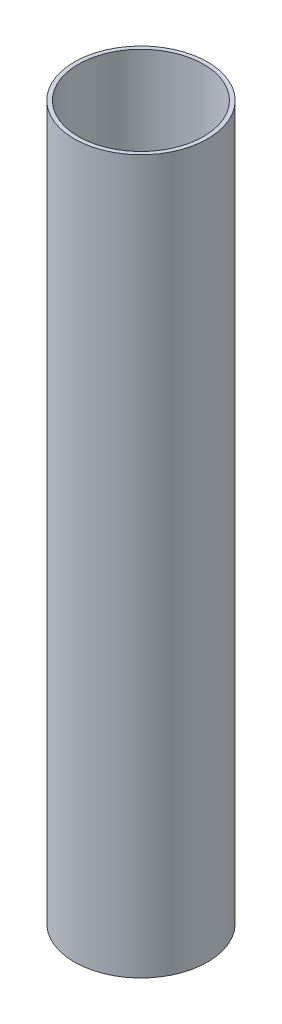
ISO-10303-21;
HEADER;
FILE_DESCRIPTION(('STEP AP214'),'2;1');
FILE_NAME('part.step','',(''),(''),'','','');
FILE_SCHEMA(('AUTOMOTIVE_DESIGN { 1 0 10303 214 1 1 1 1 }'));
ENDSEC;
DATA;
#1=APPLICATION_CONTEXT('core data for automotive mechanical design processes');
#2=APPLICATION_PROTOCOL_DEFINITION('international standard','automotive_design',2000,#1);
#3=PRODUCT_CONTEXT('',#1,'mechanical');
#4=PRODUCT('Part','Part','',(#3));
#5=PRODUCT_RELATED_PRODUCT_CATEGORY('part','',(#4));
#6=PRODUCT_DEFINITION_FORMATION('','',#4);
#7=PRODUCT_DEFINITION_CONTEXT('part definition',#1,'design');
#8=PRODUCT_DEFINITION('design','',#6,#7);
#9=PRODUCT_DEFINITION_SHAPE('','',#8);
#10=(LENGTH_UNIT() NAMED_UNIT(*) SI_UNIT(.MILLI.,.METRE.));
#11=(NAMED_UNIT(*) PLANE_ANGLE_UNIT() SI_UNIT($,.RADIAN.));
#12=(NAMED_UNIT(*) SI_UNIT($,.STERADIAN.) SOLID_ANGLE_UNIT());
#13=UNCERTAINTY_MEASURE_WITH_UNIT(LENGTH_MEASURE(1.E-05),#10,'distance_accuracy_value','');
#14=(GEOMETRIC_REPRESENTATION_CONTEXT(3) GLOBAL_UNCERTAINTY_ASSIGNED_CONTEXT((#13)) GLOBAL_UNIT_ASSIGNED_CONTEXT((#10,
#11,#12)) REPRESENTATION_CONTEXT('',''));
#15=CARTESIAN_POINT('',(0.,0.,0.));
#16=DIRECTION('',(0.,0.,1.));
#17=DIRECTION('',(1.,0.,0.));
#18=AXIS2_PLACEMENT_3D('',#15,#16,#17);
#19=CARTESIAN_POINT('',(0.,535.,0.));
#20=DIRECTION('',(0.,1.,0.));
#21=DIRECTION('',(0.,0.,1.));
#22=AXIS2_PLACEMENT_3D('',#19,#20,#21);
#23=PLANE('',#22);
#24=CARTESIAN_POINT('',(0.,535.,0.));
#25=DIRECTION('',(0.,1.,0.));
#26=DIRECTION('',(0.,0.,1.));
#27=AXIS2_PLACEMENT_3D('',#24,#25,#26);
#28=CIRCLE('',#27,50.);
#29=CARTESIAN_POINT('',(0.,535.,50.));
#30=VERTEX_POINT('',#29);
#31=EDGE_CURVE('E10',#30,#30,#28,.T.);
#32=ORIENTED_EDGE('',*,*,#31,.T.);
#33=EDGE_LOOP('',(#32));
#34=FACE_BOUND('',#33,.T.);
#35=CARTESIAN_POINT('',(0.,535.,0.));
#36=DIRECTION('',(0.,1.,0.));
#37=DIRECTION('',(0.,0.,1.));
#38=AXIS2_PLACEMENT_3D('',#35,#36,#37);
#39=CIRCLE('',#38,47.);
#40=CARTESIAN_POINT('',(0.,535.,47.));
#41=VERTEX_POINT('',#40);
#42=EDGE_CURVE('E46',#41,#41,#39,.T.);
#43=ORIENTED_EDGE('',*,*,#42,.F.);
#44=EDGE_LOOP('',(#43));
#45=FACE_BOUND('',#44,.T.);
#46=ADVANCED_FACE('F35',(#34,#45),#23,.T.);
#47=CARTESIAN_POINT('',(0.,0.,0.));
#48=DIRECTION('',(0.,1.,0.));
#49=DIRECTION('',(0.,0.,1.));
#50=AXIS2_PLACEMENT_3D('',#47,#48,#49);
#51=PLANE('',#50);
#52=CARTESIAN_POINT('',(0.,0.,0.));
#53=DIRECTION('',(0.,1.,0.));
#54=DIRECTION('',(0.,0.,1.));
#55=AXIS2_PLACEMENT_3D('',#52,#53,#54);
#56=CIRCLE('',#55,50.);
#57=CARTESIAN_POINT('',(0.,0.,50.));
#58=VERTEX_POINT('',#57);
#59=EDGE_CURVE('E39',#58,#58,#56,.T.);
#60=ORIENTED_EDGE('',*,*,#59,.F.);
#61=EDGE_LOOP('',(#60));
#62=FACE_BOUND('',#61,.T.);
#63=CARTESIAN_POINT('',(0.,0.,0.));
#64=DIRECTION('',(0.,1.,0.));
#65=DIRECTION('',(0.,0.,1.));
#66=AXIS2_PLACEMENT_3D('',#63,#64,#65);
#67=CIRCLE('',#66,47.);
#68=CARTESIAN_POINT('',(0.,0.,47.));
#69=VERTEX_POINT('',#68);
#70=EDGE_CURVE('E48',#69,#69,#67,.T.);
#71=ORIENTED_EDGE('',*,*,#70,.T.);
#72=EDGE_LOOP('',(#71));
#73=FACE_BOUND('',#72,.T.);
#74=ADVANCED_FACE('F58',(#62,#73),#51,.F.);
#75=CARTESIAN_POINT('',(0.,535.,0.));
#76=DIRECTION('',(0.,-1.,0.));
#77=DIRECTION('',(0.,0.,-1.));
#78=AXIS2_PLACEMENT_3D('',#75,#76,#77);
#79=CYLINDRICAL_SURFACE('',#78,50.);
#80=ORIENTED_EDGE('',*,*,#31,.F.);
#81=EDGE_LOOP('',(#80));
#82=FACE_BOUND('',#81,.T.);
#83=ORIENTED_EDGE('',*,*,#59,.T.);
#84=EDGE_LOOP('',(#83));
#85=FACE_BOUND('',#84,.T.);
#86=ADVANCED_FACE('F37',(#82,#85),#79,.T.);
#87=CARTESIAN_POINT('',(0.,535.,0.));
#88=DIRECTION('',(0.,-1.,0.));
#89=DIRECTION('',(0.,0.,-1.));
#90=AXIS2_PLACEMENT_3D('',#87,#88,#89);
#91=CYLINDRICAL_SURFACE('',#90,47.);
#92=ORIENTED_EDGE('',*,*,#42,.T.);
#93=EDGE_LOOP('',(#92));
#94=FACE_BOUND('',#93,.T.);
#95=ORIENTED_EDGE('',*,*,#70,.F.);
#96=EDGE_LOOP('',(#95));
#97=FACE_BOUND('',#96,.T.);
#98=ADVANCED_FACE('F54',(#94,#97),#91,.F.);
#99=CLOSED_SHELL('',(#46,#74,#86,#98));
#100=MANIFOLD_SOLID_BREP('B2',#99);
#101=ADVANCED_BREP_SHAPE_REPRESENTATION('',(#18,#100),#14);
#102=SHAPE_DEFINITION_REPRESENTATION(#9,#101);
ENDSEC;
END-ISO-10303-21;
